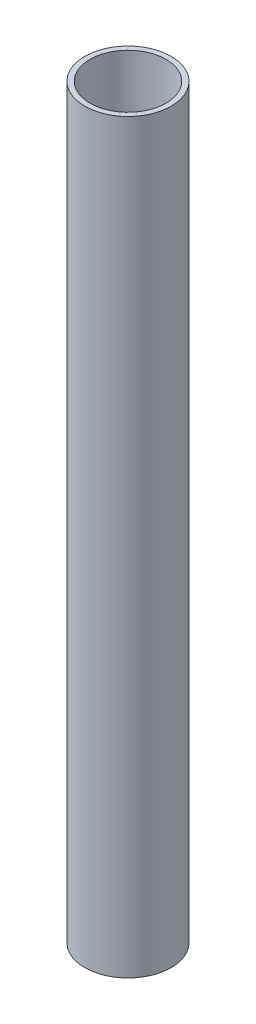
ISO-10303-21;
HEADER;
FILE_DESCRIPTION(('STEP AP214'),'2;1');
FILE_NAME('part.step','',(''),(''),'','','');
FILE_SCHEMA(('AUTOMOTIVE_DESIGN { 1 0 10303 214 1 1 1 1 }'));
ENDSEC;
DATA;
#1=APPLICATION_CONTEXT('core data for automotive mechanical design processes');
#2=APPLICATION_PROTOCOL_DEFINITION('international standard','automotive_design',2000,#1);
#3=PRODUCT_CONTEXT('',#1,'mechanical');
#4=PRODUCT('Part','Part','',(#3));
#5=PRODUCT_RELATED_PRODUCT_CATEGORY('part','',(#4));
#6=PRODUCT_DEFINITION_FORMATION('','',#4);
#7=PRODUCT_DEFINITION_CONTEXT('part definition',#1,'design');
#8=PRODUCT_DEFINITION('design','',#6,#7);
#9=PRODUCT_DEFINITION_SHAPE('','',#8);
#10=(LENGTH_UNIT() NAMED_UNIT(*) SI_UNIT(.MILLI.,.METRE.));
#11=(NAMED_UNIT(*) PLANE_ANGLE_UNIT() SI_UNIT($,.RADIAN.));
#12=(NAMED_UNIT(*) SI_UNIT($,.STERADIAN.) SOLID_ANGLE_UNIT());
#13=UNCERTAINTY_MEASURE_WITH_UNIT(LENGTH_MEASURE(1.E-05),#10,'distance_accuracy_value','');
#14=(GEOMETRIC_REPRESENTATION_CONTEXT(3) GLOBAL_UNCERTAINTY_ASSIGNED_CONTEXT((#13)) GLOBAL_UNIT_ASSIGNED_CONTEXT((#10,
#11,#12)) REPRESENTATION_CONTEXT('',''));
#15=CARTESIAN_POINT('',(0.,0.,0.));
#16=DIRECTION('',(0.,0.,1.));
#17=DIRECTION('',(1.,0.,0.));
#18=AXIS2_PLACEMENT_3D('',#15,#16,#17);
#19=CARTESIAN_POINT('',(0.,431.8,0.));
#20=DIRECTION('',(0.,1.,0.));
#21=DIRECTION('',(0.,0.,1.));
#22=AXIS2_PLACEMENT_3D('',#19,#20,#21);
#23=PLANE('',#22);
#24=CARTESIAN_POINT('',(0.,431.8,0.));
#25=DIRECTION('',(0.,1.,0.));
#26=DIRECTION('',(0.,0.,1.));
#27=AXIS2_PLACEMENT_3D('',#24,#25,#26);
#28=CIRCLE('',#27,25.);
#29=CARTESIAN_POINT('',(0.,431.8,25.));
#30=VERTEX_POINT('',#29);
#31=EDGE_CURVE('E10',#30,#30,#28,.T.);
#32=ORIENTED_EDGE('',*,*,#31,.T.);
#33=EDGE_LOOP('',(#32));
#34=FACE_BOUND('',#33,.T.);
#35=CARTESIAN_POINT('',(0.,431.8,0.));
#36=DIRECTION('',(0.,1.,0.));
#37=DIRECTION('',(0.,0.,1.));
#38=AXIS2_PLACEMENT_3D('',#35,#36,#37);
#39=CIRCLE('',#38,22.);
#40=CARTESIAN_POINT('',(0.,431.8,22.));
#41=VERTEX_POINT('',#40);
#42=EDGE_CURVE('E50',#41,#41,#39,.T.);
#43=ORIENTED_EDGE('',*,*,#42,.F.);
#44=EDGE_LOOP('',(#43));
#45=FACE_BOUND('',#44,.T.);
#46=ADVANCED_FACE('F37',(#34,#45),#23,.T.);
#47=CARTESIAN_POINT('',(0.,0.,0.));
#48=DIRECTION('',(0.,1.,0.));
#49=DIRECTION('',(0.,0.,1.));
#50=AXIS2_PLACEMENT_3D('',#47,#48,#49);
#51=PLANE('',#50);
#52=CARTESIAN_POINT('',(0.,0.,0.));
#53=DIRECTION('',(0.,1.,0.));
#54=DIRECTION('',(0.,0.,1.));
#55=AXIS2_PLACEMENT_3D('',#52,#53,#54);
#56=CIRCLE('',#55,25.);
#57=CARTESIAN_POINT('',(0.,0.,25.));
#58=VERTEX_POINT('',#57);
#59=EDGE_CURVE('E41',#58,#58,#56,.T.);
#60=ORIENTED_EDGE('',*,*,#59,.F.);
#61=EDGE_LOOP('',(#60));
#62=FACE_BOUND('',#61,.T.);
#63=CARTESIAN_POINT('',(0.,0.,0.));
#64=DIRECTION('',(0.,1.,0.));
#65=DIRECTION('',(0.,0.,1.));
#66=AXIS2_PLACEMENT_3D('',#63,#64,#65);
#67=CIRCLE('',#66,22.);
#68=CARTESIAN_POINT('',(0.,0.,22.));
#69=VERTEX_POINT('',#68);
#70=EDGE_CURVE('E52',#69,#69,#67,.T.);
#71=ORIENTED_EDGE('',*,*,#70,.T.);
#72=EDGE_LOOP('',(#71));
#73=FACE_BOUND('',#72,.T.);
#74=ADVANCED_FACE('F64',(#62,#73),#51,.F.);
#75=CARTESIAN_POINT('',(0.,431.8,0.));
#76=DIRECTION('',(0.,-1.,0.));
#77=DIRECTION('',(0.,0.,-1.));
#78=AXIS2_PLACEMENT_3D('',#75,#76,#77);
#79=CYLINDRICAL_SURFACE('',#78,25.);
#80=ORIENTED_EDGE('',*,*,#31,.F.);
#81=EDGE_LOOP('',(#80));
#82=FACE_BOUND('',#81,.T.);
#83=ORIENTED_EDGE('',*,*,#59,.T.);
#84=EDGE_LOOP('',(#83));
#85=FACE_BOUND('',#84,.T.);
#86=ADVANCED_FACE('F39',(#82,#85),#79,.T.);
#87=CARTESIAN_POINT('',(0.,431.8,0.));
#88=DIRECTION('',(0.,-1.,0.));
#89=DIRECTION('',(0.,0.,-1.));
#90=AXIS2_PLACEMENT_3D('',#87,#88,#89);
#91=CYLINDRICAL_SURFACE('',#90,22.);
#92=ORIENTED_EDGE('',*,*,#42,.T.);
#93=EDGE_LOOP('',(#92));
#94=FACE_BOUND('',#93,.T.);
#95=ORIENTED_EDGE('',*,*,#70,.F.);
#96=EDGE_LOOP('',(#95));
#97=FACE_BOUND('',#96,.T.);
#98=ADVANCED_FACE('F60',(#94,#97),#91,.F.);
#99=CLOSED_SHELL('',(#46,#74,#86,#98));
#100=MANIFOLD_SOLID_BREP('B2',#99);
#101=ADVANCED_BREP_SHAPE_REPRESENTATION('',(#18,#100),#14);
#102=SHAPE_DEFINITION_REPRESENTATION(#9,#101);
ENDSEC;
END-ISO-10303-21;
